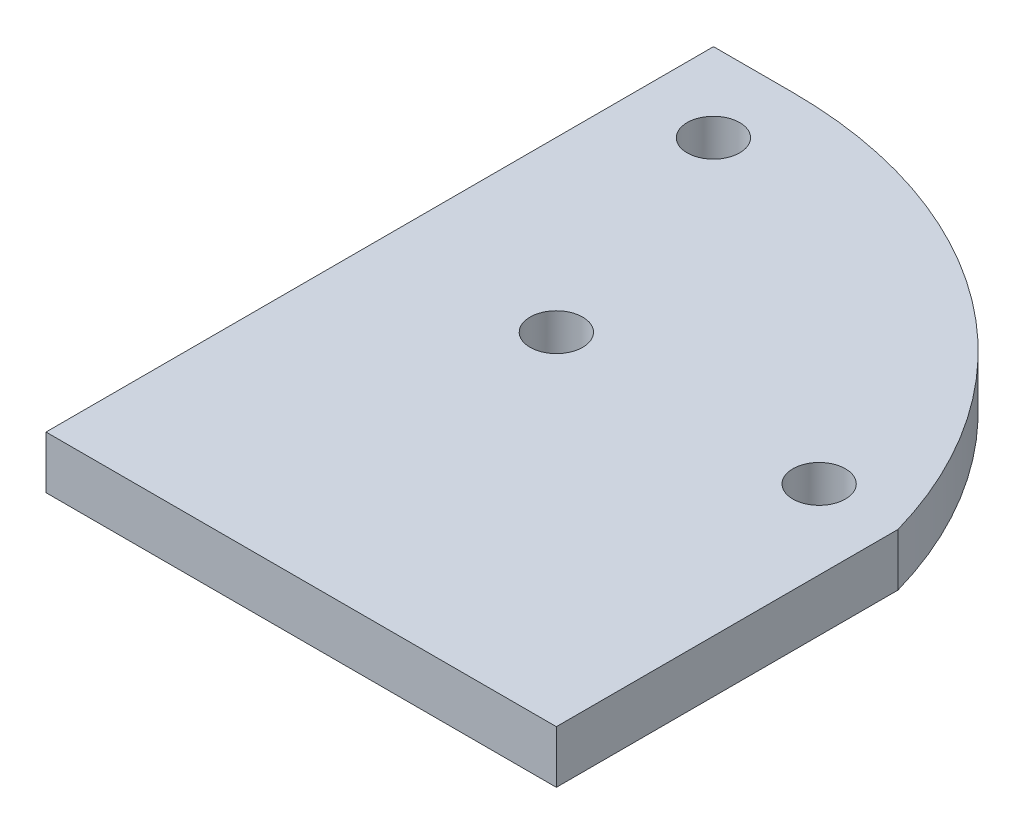
ISO-10303-21;
HEADER;
FILE_DESCRIPTION(('STEP AP214'),'2;1');
FILE_NAME('part.step','',(''),(''),'','','');
FILE_SCHEMA(('AUTOMOTIVE_DESIGN { 1 0 10303 214 1 1 1 1 }'));
ENDSEC;
DATA;
#1=APPLICATION_CONTEXT('core data for automotive mechanical design processes');
#2=APPLICATION_PROTOCOL_DEFINITION('international standard','automotive_design',2000,#1);
#3=PRODUCT_CONTEXT('',#1,'mechanical');
#4=PRODUCT('Part','Part','',(#3));
#5=PRODUCT_RELATED_PRODUCT_CATEGORY('part','',(#4));
#6=PRODUCT_DEFINITION_FORMATION('','',#4);
#7=PRODUCT_DEFINITION_CONTEXT('part definition',#1,'design');
#8=PRODUCT_DEFINITION('design','',#6,#7);
#9=PRODUCT_DEFINITION_SHAPE('','',#8);
#10=(LENGTH_UNIT() NAMED_UNIT(*) SI_UNIT(.MILLI.,.METRE.));
#11=(NAMED_UNIT(*) PLANE_ANGLE_UNIT() SI_UNIT($,.RADIAN.));
#12=(NAMED_UNIT(*) SI_UNIT($,.STERADIAN.) SOLID_ANGLE_UNIT());
#13=UNCERTAINTY_MEASURE_WITH_UNIT(LENGTH_MEASURE(1.E-05),#10,'distance_accuracy_value','');
#14=(GEOMETRIC_REPRESENTATION_CONTEXT(3) GLOBAL_UNCERTAINTY_ASSIGNED_CONTEXT((#13)) GLOBAL_UNIT_ASSIGNED_CONTEXT((#10,
#11,#12)) REPRESENTATION_CONTEXT('',''));
#15=CARTESIAN_POINT('',(0.,0.,0.));
#16=DIRECTION('',(0.,0.,1.));
#17=DIRECTION('',(1.,0.,0.));
#18=AXIS2_PLACEMENT_3D('',#15,#16,#17);
#19=CARTESIAN_POINT('',(0.,10.,0.));
#20=DIRECTION('',(0.,0.,-1.));
#21=DIRECTION('',(-1.,0.,0.));
#22=AXIS2_PLACEMENT_3D('',#19,#20,#21);
#23=PLANE('',#22);
#24=DIRECTION('',(1.,0.,0.));
#25=VECTOR('',#24,1.);
#26=CARTESIAN_POINT('',(0.,0.,0.));
#27=LINE('',#26,#25);
#28=CARTESIAN_POINT('',(0.,0.,0.));
#29=VERTEX_POINT('',#28);
#30=CARTESIAN_POINT('',(97.1,0.,0.));
#31=VERTEX_POINT('',#30);
#32=EDGE_CURVE('E110',#29,#31,#27,.T.);
#33=ORIENTED_EDGE('',*,*,#32,.T.);
#34=DIRECTION('',(0.,-1.,0.));
#35=VECTOR('',#34,1.);
#36=CARTESIAN_POINT('',(97.1,10.,0.));
#37=LINE('',#36,#35);
#38=CARTESIAN_POINT('',(97.1,10.,0.));
#39=VERTEX_POINT('',#38);
#40=EDGE_CURVE('E11',#39,#31,#37,.T.);
#41=ORIENTED_EDGE('',*,*,#40,.F.);
#42=DIRECTION('',(1.,0.,0.));
#43=VECTOR('',#42,1.);
#44=CARTESIAN_POINT('',(0.,10.,0.));
#45=LINE('',#44,#43);
#46=CARTESIAN_POINT('',(0.,10.,0.));
#47=VERTEX_POINT('',#46);
#48=EDGE_CURVE('E118',#47,#39,#45,.T.);
#49=ORIENTED_EDGE('',*,*,#48,.F.);
#50=DIRECTION('',(0.,-1.,0.));
#51=VECTOR('',#50,1.);
#52=CARTESIAN_POINT('',(0.,10.,0.));
#53=LINE('',#52,#51);
#54=EDGE_CURVE('E106',#47,#29,#53,.T.);
#55=ORIENTED_EDGE('',*,*,#54,.T.);
#56=EDGE_LOOP('',(#33,#41,#49,#55));
#57=FACE_BOUND('',#56,.T.);
#58=ADVANCED_FACE('F34',(#57),#23,.F.);
#59=CARTESIAN_POINT('',(97.1,10.,0.));
#60=DIRECTION('',(-1.,0.,0.));
#61=DIRECTION('',(0.,0.,1.));
#62=AXIS2_PLACEMENT_3D('',#59,#60,#61);
#63=PLANE('',#62);
#64=DIRECTION('',(0.,0.,-1.));
#65=VECTOR('',#64,1.);
#66=CARTESIAN_POINT('',(97.1,0.,0.));
#67=LINE('',#66,#65);
#68=CARTESIAN_POINT('',(97.1,0.,-65.));
#69=VERTEX_POINT('',#68);
#70=EDGE_CURVE('E113',#31,#69,#67,.T.);
#71=ORIENTED_EDGE('',*,*,#70,.T.);
#72=DIRECTION('',(0.,-1.,0.));
#73=VECTOR('',#72,1.);
#74=CARTESIAN_POINT('',(97.1,10.,-65.));
#75=LINE('',#74,#73);
#76=CARTESIAN_POINT('',(97.1,10.,-65.));
#77=VERTEX_POINT('',#76);
#78=EDGE_CURVE('E43',#77,#69,#75,.T.);
#79=ORIENTED_EDGE('',*,*,#78,.F.);
#80=DIRECTION('',(0.,0.,-1.));
#81=VECTOR('',#80,1.);
#82=CARTESIAN_POINT('',(97.1,10.,0.));
#83=LINE('',#82,#81);
#84=EDGE_CURVE('E86',#39,#77,#83,.T.);
#85=ORIENTED_EDGE('',*,*,#84,.F.);
#86=ORIENTED_EDGE('',*,*,#40,.T.);
#87=EDGE_LOOP('',(#71,#79,#85,#86));
#88=FACE_BOUND('',#87,.T.);
#89=ADVANCED_FACE('F158',(#88),#63,.F.);
#90=CARTESIAN_POINT('',(15.,10.,-41.6418548387097));
#91=DIRECTION('',(0.,-1.,0.));
#92=DIRECTION('',(0.,0.,-1.));
#93=AXIS2_PLACEMENT_3D('',#90,#91,#92);
#94=CYLINDRICAL_SURFACE('',#93,85.3581451612903);
#95=CARTESIAN_POINT('',(15.,0.,-41.6418548387097));
#96=DIRECTION('',(0.,1.,0.));
#97=DIRECTION('',(0.,0.,-1.));
#98=AXIS2_PLACEMENT_3D('',#95,#96,#97);
#99=CIRCLE('',#98,85.3581451612903);
#100=CARTESIAN_POINT('',(15.,0.,-127.));
#101=VERTEX_POINT('',#100);
#102=EDGE_CURVE('E101',#69,#101,#99,.T.);
#103=ORIENTED_EDGE('',*,*,#102,.T.);
#104=DIRECTION('',(0.,-1.,0.));
#105=VECTOR('',#104,1.);
#106=CARTESIAN_POINT('',(15.,10.,-127.));
#107=LINE('',#106,#105);
#108=CARTESIAN_POINT('',(15.,10.,-127.));
#109=VERTEX_POINT('',#108);
#110=EDGE_CURVE('E98',#109,#101,#107,.T.);
#111=ORIENTED_EDGE('',*,*,#110,.F.);
#112=CARTESIAN_POINT('',(15.,10.,-41.6418548387097));
#113=DIRECTION('',(0.,1.,0.));
#114=DIRECTION('',(0.,0.,-1.));
#115=AXIS2_PLACEMENT_3D('',#112,#113,#114);
#116=CIRCLE('',#115,85.3581451612903);
#117=EDGE_CURVE('E90',#77,#109,#116,.T.);
#118=ORIENTED_EDGE('',*,*,#117,.F.);
#119=ORIENTED_EDGE('',*,*,#78,.T.);
#120=EDGE_LOOP('',(#103,#111,#118,#119));
#121=FACE_BOUND('',#120,.T.);
#122=ADVANCED_FACE('F99',(#121),#94,.T.);
#123=CARTESIAN_POINT('',(0.,10.,-127.));
#124=DIRECTION('',(0.,0.,1.));
#125=DIRECTION('',(1.,0.,0.));
#126=AXIS2_PLACEMENT_3D('',#123,#124,#125);
#127=PLANE('',#126);
#128=DIRECTION('',(-1.,0.,0.));
#129=VECTOR('',#128,1.);
#130=CARTESIAN_POINT('',(0.,0.,-127.));
#131=LINE('',#130,#129);
#132=CARTESIAN_POINT('',(0.,0.,-127.));
#133=VERTEX_POINT('',#132);
#134=EDGE_CURVE('E72',#101,#133,#131,.T.);
#135=ORIENTED_EDGE('',*,*,#134,.T.);
#136=DIRECTION('',(0.,-1.,0.));
#137=VECTOR('',#136,1.);
#138=CARTESIAN_POINT('',(0.,10.,-127.));
#139=LINE('',#138,#137);
#140=CARTESIAN_POINT('',(0.,10.,-127.));
#141=VERTEX_POINT('',#140);
#142=EDGE_CURVE('E102',#141,#133,#139,.T.);
#143=ORIENTED_EDGE('',*,*,#142,.F.);
#144=DIRECTION('',(-1.,0.,0.));
#145=VECTOR('',#144,1.);
#146=CARTESIAN_POINT('',(0.,10.,-127.));
#147=LINE('',#146,#145);
#148=EDGE_CURVE('E94',#109,#141,#147,.T.);
#149=ORIENTED_EDGE('',*,*,#148,.F.);
#150=ORIENTED_EDGE('',*,*,#110,.T.);
#151=EDGE_LOOP('',(#135,#143,#149,#150));
#152=FACE_BOUND('',#151,.T.);
#153=ADVANCED_FACE('F104',(#152),#127,.F.);
#154=CARTESIAN_POINT('',(0.,10.,0.));
#155=DIRECTION('',(1.,0.,0.));
#156=DIRECTION('',(0.,0.,-1.));
#157=AXIS2_PLACEMENT_3D('',#154,#155,#156);
#158=PLANE('',#157);
#159=DIRECTION('',(0.,0.,1.));
#160=VECTOR('',#159,1.);
#161=CARTESIAN_POINT('',(0.,0.,0.));
#162=LINE('',#161,#160);
#163=EDGE_CURVE('E78',#133,#29,#162,.T.);
#164=ORIENTED_EDGE('',*,*,#163,.T.);
#165=ORIENTED_EDGE('',*,*,#54,.F.);
#166=DIRECTION('',(0.,0.,1.));
#167=VECTOR('',#166,1.);
#168=CARTESIAN_POINT('',(0.,10.,0.));
#169=LINE('',#168,#167);
#170=EDGE_CURVE('E52',#141,#47,#169,.T.);
#171=ORIENTED_EDGE('',*,*,#170,.F.);
#172=ORIENTED_EDGE('',*,*,#142,.T.);
#173=EDGE_LOOP('',(#164,#165,#171,#172));
#174=FACE_BOUND('',#173,.T.);
#175=ADVANCED_FACE('F147',(#174),#158,.F.);
#176=CARTESIAN_POINT('',(15.,10.,-41.6418548387097));
#177=DIRECTION('',(0.,-1.,0.));
#178=DIRECTION('',(0.,0.,-1.));
#179=AXIS2_PLACEMENT_3D('',#176,#177,#178);
#180=PLANE('',#179);
#181=CARTESIAN_POINT('',(14.9989928337167,10.,-111.984631039295));
#182=DIRECTION('',(0.,1.,0.));
#183=DIRECTION('',(0.,0.,1.));
#184=AXIS2_PLACEMENT_3D('',#181,#182,#183);
#185=CIRCLE('',#184,5.00000000000001);
#186=CARTESIAN_POINT('',(14.9989928337167,10.,-106.984631039295));
#187=VERTEX_POINT('',#186);
#188=EDGE_CURVE('E125',#187,#187,#185,.T.);
#189=ORIENTED_EDGE('',*,*,#188,.F.);
#190=EDGE_LOOP('',(#189));
#191=FACE_BOUND('',#190,.T.);
#192=CARTESIAN_POINT('',(82.1,10.,-65.));
#193=DIRECTION('',(0.,1.,0.));
#194=DIRECTION('',(0.,0.,1.));
#195=AXIS2_PLACEMENT_3D('',#192,#193,#194);
#196=CIRCLE('',#195,5.00000000000001);
#197=CARTESIAN_POINT('',(82.1,10.,-60.));
#198=VERTEX_POINT('',#197);
#199=EDGE_CURVE('E221',#198,#198,#196,.T.);
#200=ORIENTED_EDGE('',*,*,#199,.F.);
#201=EDGE_LOOP('',(#200));
#202=FACE_BOUND('',#201,.T.);
#203=CARTESIAN_POINT('',(32.1,10.,-65.));
#204=DIRECTION('',(0.,1.,0.));
#205=DIRECTION('',(0.,0.,1.));
#206=AXIS2_PLACEMENT_3D('',#203,#204,#205);
#207=CIRCLE('',#206,4.99999999999999);
#208=CARTESIAN_POINT('',(32.1,10.,-60.));
#209=VERTEX_POINT('',#208);
#210=EDGE_CURVE('E223',#209,#209,#207,.T.);
#211=ORIENTED_EDGE('',*,*,#210,.F.);
#212=EDGE_LOOP('',(#211));
#213=FACE_BOUND('',#212,.T.);
#214=ORIENTED_EDGE('',*,*,#48,.T.);
#215=ORIENTED_EDGE('',*,*,#84,.T.);
#216=ORIENTED_EDGE('',*,*,#117,.T.);
#217=ORIENTED_EDGE('',*,*,#148,.T.);
#218=ORIENTED_EDGE('',*,*,#170,.T.);
#219=EDGE_LOOP('',(#214,#215,#216,#217,#218));
#220=FACE_BOUND('',#219,.T.);
#221=ADVANCED_FACE('F92',(#191,#202,#213,#220),#180,.F.);
#222=CARTESIAN_POINT('',(15.,0.,-41.6418548387097));
#223=DIRECTION('',(0.,-1.,0.));
#224=DIRECTION('',(0.,0.,-1.));
#225=AXIS2_PLACEMENT_3D('',#222,#223,#224);
#226=PLANE('',#225);
#227=CARTESIAN_POINT('',(14.9989928337167,0.,-111.984631039295));
#228=DIRECTION('',(0.,-1.,0.));
#229=DIRECTION('',(0.,0.,-1.));
#230=AXIS2_PLACEMENT_3D('',#227,#228,#229);
#231=CIRCLE('',#230,5.00000000000001);
#232=CARTESIAN_POINT('',(14.9989928337167,0.,-116.984631039295));
#233=VERTEX_POINT('',#232);
#234=EDGE_CURVE('E37',#233,#233,#231,.T.);
#235=ORIENTED_EDGE('',*,*,#234,.F.);
#236=EDGE_LOOP('',(#235));
#237=FACE_BOUND('',#236,.T.);
#238=CARTESIAN_POINT('',(82.1,0.,-65.));
#239=DIRECTION('',(0.,-1.,0.));
#240=DIRECTION('',(0.,0.,-1.));
#241=AXIS2_PLACEMENT_3D('',#238,#239,#240);
#242=CIRCLE('',#241,5.00000000000001);
#243=CARTESIAN_POINT('',(82.1,0.,-70.));
#244=VERTEX_POINT('',#243);
#245=EDGE_CURVE('E124',#244,#244,#242,.T.);
#246=ORIENTED_EDGE('',*,*,#245,.F.);
#247=EDGE_LOOP('',(#246));
#248=FACE_BOUND('',#247,.T.);
#249=CARTESIAN_POINT('',(32.1,0.,-65.));
#250=DIRECTION('',(0.,-1.,0.));
#251=DIRECTION('',(0.,0.,-1.));
#252=AXIS2_PLACEMENT_3D('',#249,#250,#251);
#253=CIRCLE('',#252,4.99999999999999);
#254=CARTESIAN_POINT('',(32.1,0.,-70.));
#255=VERTEX_POINT('',#254);
#256=EDGE_CURVE('E122',#255,#255,#253,.T.);
#257=ORIENTED_EDGE('',*,*,#256,.F.);
#258=EDGE_LOOP('',(#257));
#259=FACE_BOUND('',#258,.T.);
#260=ORIENTED_EDGE('',*,*,#32,.F.);
#261=ORIENTED_EDGE('',*,*,#163,.F.);
#262=ORIENTED_EDGE('',*,*,#134,.F.);
#263=ORIENTED_EDGE('',*,*,#102,.F.);
#264=ORIENTED_EDGE('',*,*,#70,.F.);
#265=EDGE_LOOP('',(#260,#261,#262,#263,#264));
#266=FACE_BOUND('',#265,.T.);
#267=ADVANCED_FACE('F135',(#237,#248,#259,#266),#226,.T.);
#268=CARTESIAN_POINT('',(32.1,-1.2E-05,-65.));
#269=DIRECTION('',(0.,1.,0.));
#270=DIRECTION('',(0.,0.,1.));
#271=AXIS2_PLACEMENT_3D('',#268,#269,#270);
#272=CYLINDRICAL_SURFACE('',#271,4.99999999999999);
#273=ORIENTED_EDGE('',*,*,#256,.T.);
#274=EDGE_LOOP('',(#273));
#275=FACE_BOUND('',#274,.T.);
#276=ORIENTED_EDGE('',*,*,#210,.T.);
#277=EDGE_LOOP('',(#276));
#278=FACE_BOUND('',#277,.T.);
#279=ADVANCED_FACE('F138',(#275,#278),#272,.F.);
#280=CARTESIAN_POINT('',(82.1,-1.2E-05,-65.));
#281=DIRECTION('',(0.,1.,0.));
#282=DIRECTION('',(0.,0.,1.));
#283=AXIS2_PLACEMENT_3D('',#280,#281,#282);
#284=CYLINDRICAL_SURFACE('',#283,5.00000000000001);
#285=ORIENTED_EDGE('',*,*,#245,.T.);
#286=EDGE_LOOP('',(#285));
#287=FACE_BOUND('',#286,.T.);
#288=ORIENTED_EDGE('',*,*,#199,.T.);
#289=EDGE_LOOP('',(#288));
#290=FACE_BOUND('',#289,.T.);
#291=ADVANCED_FACE('F197',(#287,#290),#284,.F.);
#292=CARTESIAN_POINT('',(14.9989928337167,-1.2E-05,-111.984631039295));
#293=DIRECTION('',(0.,1.,0.));
#294=DIRECTION('',(0.,0.,1.));
#295=AXIS2_PLACEMENT_3D('',#292,#293,#294);
#296=CYLINDRICAL_SURFACE('',#295,5.00000000000001);
#297=ORIENTED_EDGE('',*,*,#234,.T.);
#298=EDGE_LOOP('',(#297));
#299=FACE_BOUND('',#298,.T.);
#300=ORIENTED_EDGE('',*,*,#188,.T.);
#301=EDGE_LOOP('',(#300));
#302=FACE_BOUND('',#301,.T.);
#303=ADVANCED_FACE('F132',(#299,#302),#296,.F.);
#304=CLOSED_SHELL('',(#58,#89,#122,#153,#175,#221,#267,#279,#291,#303));
#305=MANIFOLD_SOLID_BREP('B2',#304);
#306=ADVANCED_BREP_SHAPE_REPRESENTATION('',(#18,#305),#14);
#307=SHAPE_DEFINITION_REPRESENTATION(#9,#306);
ENDSEC;
END-ISO-10303-21;
